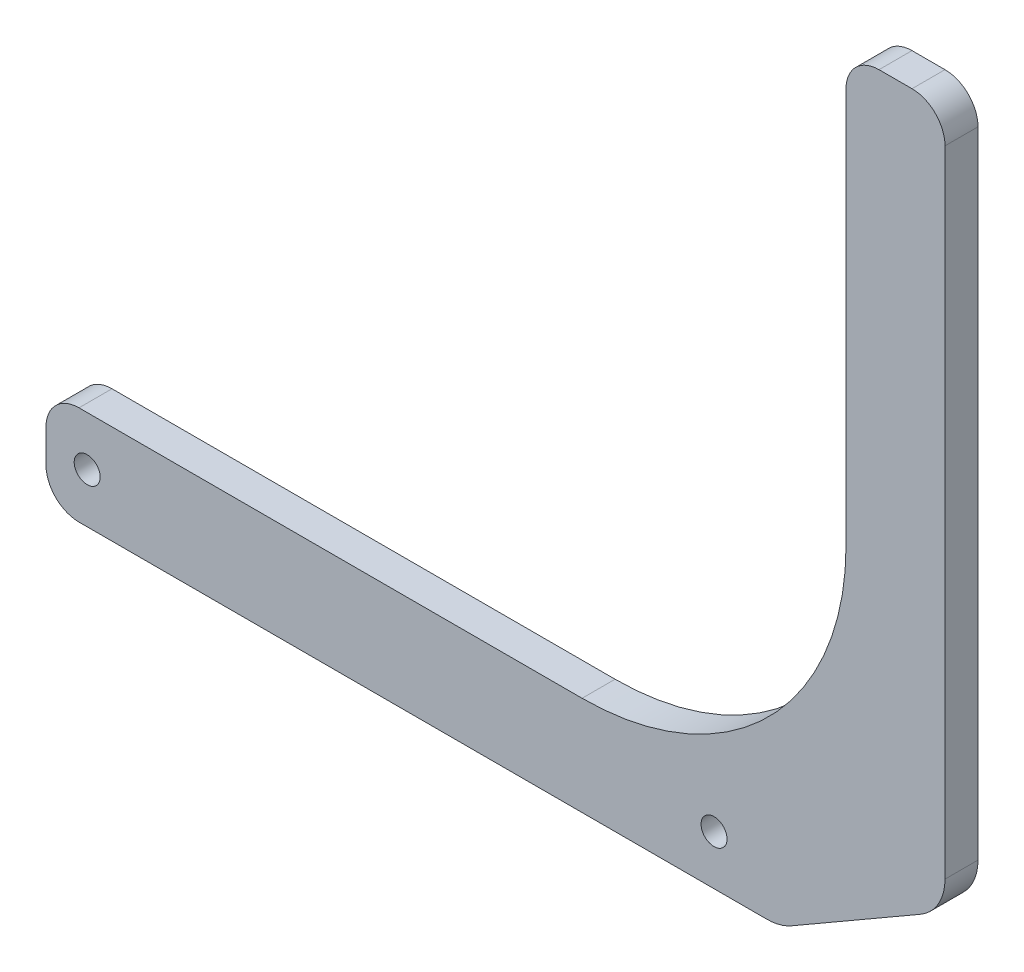
ISO-10303-21;
HEADER;
FILE_DESCRIPTION(('STEP AP214'),'2;1');
FILE_NAME('part.step','',(''),(''),'','','');
FILE_SCHEMA(('AUTOMOTIVE_DESIGN { 1 0 10303 214 1 1 1 1 }'));
ENDSEC;
DATA;
#1=APPLICATION_CONTEXT('core data for automotive mechanical design processes');
#2=APPLICATION_PROTOCOL_DEFINITION('international standard','automotive_design',2000,#1);
#3=PRODUCT_CONTEXT('',#1,'mechanical');
#4=PRODUCT('Part','Part','',(#3));
#5=PRODUCT_RELATED_PRODUCT_CATEGORY('part','',(#4));
#6=PRODUCT_DEFINITION_FORMATION('','',#4);
#7=PRODUCT_DEFINITION_CONTEXT('part definition',#1,'design');
#8=PRODUCT_DEFINITION('design','',#6,#7);
#9=PRODUCT_DEFINITION_SHAPE('','',#8);
#10=(LENGTH_UNIT() NAMED_UNIT(*) SI_UNIT(.MILLI.,.METRE.));
#11=(NAMED_UNIT(*) PLANE_ANGLE_UNIT() SI_UNIT($,.RADIAN.));
#12=(NAMED_UNIT(*) SI_UNIT($,.STERADIAN.) SOLID_ANGLE_UNIT());
#13=UNCERTAINTY_MEASURE_WITH_UNIT(LENGTH_MEASURE(1.E-05),#10,'distance_accuracy_value','');
#14=(GEOMETRIC_REPRESENTATION_CONTEXT(3) GLOBAL_UNCERTAINTY_ASSIGNED_CONTEXT((#13)) GLOBAL_UNIT_ASSIGNED_CONTEXT((#10,
#11,#12)) REPRESENTATION_CONTEXT('',''));
#15=CARTESIAN_POINT('',(0.,0.,0.));
#16=DIRECTION('',(0.,0.,1.));
#17=DIRECTION('',(1.,0.,0.));
#18=AXIS2_PLACEMENT_3D('',#15,#16,#17);
#19=CARTESIAN_POINT('',(-88.9,-9.525,6.35));
#20=DIRECTION('',(0.,1.,0.));
#21=DIRECTION('',(0.,0.,1.));
#22=AXIS2_PLACEMENT_3D('',#19,#20,#21);
#23=PLANE('',#22);
#24=DIRECTION('',(1.,0.,0.));
#25=VECTOR('',#24,1.);
#26=CARTESIAN_POINT('',(-88.9,-9.525,0.));
#27=LINE('',#26,#25);
#28=CARTESIAN_POINT('',(-77.7748,-9.525,0.));
#29=VERTEX_POINT('',#28);
#30=CARTESIAN_POINT('',(54.5977839420934,-9.525,0.));
#31=VERTEX_POINT('',#30);
#32=EDGE_CURVE('E171',#29,#31,#27,.T.);
#33=ORIENTED_EDGE('',*,*,#32,.T.);
#34=DIRECTION('',(0.,0.,-1.));
#35=VECTOR('',#34,1.);
#36=CARTESIAN_POINT('',(54.5977839420934,-9.525,6.35));
#37=LINE('',#36,#35);
#38=CARTESIAN_POINT('',(54.5977839420934,-9.525,6.35));
#39=VERTEX_POINT('',#38);
#40=EDGE_CURVE('E11',#31,#39,#37,.F.);
#41=ORIENTED_EDGE('',*,*,#40,.T.);
#42=DIRECTION('',(1.,0.,0.));
#43=VECTOR('',#42,1.);
#44=CARTESIAN_POINT('',(-88.9,-9.525,6.35));
#45=LINE('',#44,#43);
#46=CARTESIAN_POINT('',(-77.7748,-9.525,6.35));
#47=VERTEX_POINT('',#46);
#48=EDGE_CURVE('E176',#47,#39,#45,.T.);
#49=ORIENTED_EDGE('',*,*,#48,.F.);
#50=DIRECTION('',(0.,0.,1.));
#51=VECTOR('',#50,1.);
#52=CARTESIAN_POINT('',(-77.7748,-9.525,6.35));
#53=LINE('',#52,#51);
#54=EDGE_CURVE('E206',#47,#29,#53,.F.);
#55=ORIENTED_EDGE('',*,*,#54,.T.);
#56=EDGE_LOOP('',(#33,#41,#49,#55));
#57=FACE_BOUND('',#56,.T.);
#58=ADVANCED_FACE('F36',(#57),#23,.F.);
#59=CARTESIAN_POINT('',(88.9,9.525,6.35));
#60=DIRECTION('',(-1.,0.,0.));
#61=DIRECTION('',(0.,0.,1.));
#62=AXIS2_PLACEMENT_3D('',#59,#60,#61);
#63=PLANE('',#62);
#64=DIRECTION('',(0.,1.,0.));
#65=VECTOR('',#64,1.);
#66=CARTESIAN_POINT('',(88.9,9.525,6.35));
#67=LINE('',#66,#65);
#68=CARTESIAN_POINT('',(88.9,14.3051323608018,6.35));
#69=VERTEX_POINT('',#68);
#70=CARTESIAN_POINT('',(88.9,136.525,6.35));
#71=VERTEX_POINT('',#70);
#72=EDGE_CURVE('E235',#69,#71,#67,.T.);
#73=ORIENTED_EDGE('',*,*,#72,.F.);
#74=DIRECTION('',(0.,0.,1.));
#75=VECTOR('',#74,1.);
#76=CARTESIAN_POINT('',(88.9,14.3051323608018,0.));
#77=LINE('',#76,#75);
#78=CARTESIAN_POINT('',(88.9,14.3051323608018,0.));
#79=VERTEX_POINT('',#78);
#80=EDGE_CURVE('E220',#69,#79,#77,.F.);
#81=ORIENTED_EDGE('',*,*,#80,.T.);
#82=DIRECTION('',(0.,1.,0.));
#83=VECTOR('',#82,1.);
#84=CARTESIAN_POINT('',(88.9,9.525,0.));
#85=LINE('',#84,#83);
#86=CARTESIAN_POINT('',(88.9,136.525,0.));
#87=VERTEX_POINT('',#86);
#88=EDGE_CURVE('E166',#79,#87,#85,.T.);
#89=ORIENTED_EDGE('',*,*,#88,.T.);
#90=DIRECTION('',(0.,0.,-1.));
#91=VECTOR('',#90,1.);
#92=CARTESIAN_POINT('',(88.9,136.525,6.35));
#93=LINE('',#92,#91);
#94=EDGE_CURVE('E146',#87,#71,#93,.F.);
#95=ORIENTED_EDGE('',*,*,#94,.T.);
#96=EDGE_LOOP('',(#73,#81,#89,#95));
#97=FACE_BOUND('',#96,.T.);
#98=ADVANCED_FACE('F239',(#97),#63,.F.);
#99=CARTESIAN_POINT('',(69.85,142.875,6.35));
#100=DIRECTION('',(0.,-1.,0.));
#101=DIRECTION('',(0.,0.,-1.));
#102=AXIS2_PLACEMENT_3D('',#99,#100,#101);
#103=PLANE('',#102);
#104=DIRECTION('',(-1.,0.,0.));
#105=VECTOR('',#104,1.);
#106=CARTESIAN_POINT('',(69.85,142.875,6.35));
#107=LINE('',#106,#105);
#108=CARTESIAN_POINT('',(82.55,142.875,6.35));
#109=VERTEX_POINT('',#108);
#110=CARTESIAN_POINT('',(76.2,142.875,6.35));
#111=VERTEX_POINT('',#110);
#112=EDGE_CURVE('E159',#109,#111,#107,.T.);
#113=ORIENTED_EDGE('',*,*,#112,.F.);
#114=DIRECTION('',(0.,0.,-1.));
#115=VECTOR('',#114,1.);
#116=CARTESIAN_POINT('',(82.55,142.875,6.35));
#117=LINE('',#116,#115);
#118=CARTESIAN_POINT('',(82.55,142.875,0.));
#119=VERTEX_POINT('',#118);
#120=EDGE_CURVE('E144',#109,#119,#117,.T.);
#121=ORIENTED_EDGE('',*,*,#120,.T.);
#122=DIRECTION('',(-1.,0.,0.));
#123=VECTOR('',#122,1.);
#124=CARTESIAN_POINT('',(69.85,142.875,0.));
#125=LINE('',#124,#123);
#126=CARTESIAN_POINT('',(76.2,142.875,0.));
#127=VERTEX_POINT('',#126);
#128=EDGE_CURVE('E156',#119,#127,#125,.T.);
#129=ORIENTED_EDGE('',*,*,#128,.T.);
#130=DIRECTION('',(0.,0.,-1.));
#131=VECTOR('',#130,1.);
#132=CARTESIAN_POINT('',(76.2,142.875,6.35));
#133=LINE('',#132,#131);
#134=EDGE_CURVE('E161',#127,#111,#133,.F.);
#135=ORIENTED_EDGE('',*,*,#134,.T.);
#136=EDGE_LOOP('',(#113,#121,#129,#135));
#137=FACE_BOUND('',#136,.T.);
#138=ADVANCED_FACE('F155',(#137),#103,.F.);
#139=CARTESIAN_POINT('',(69.85,9.525,6.35));
#140=DIRECTION('',(1.,0.,0.));
#141=DIRECTION('',(0.,1.,0.));
#142=AXIS2_PLACEMENT_3D('',#139,#140,#141);
#143=PLANE('',#142);
#144=DIRECTION('',(0.,-1.,0.));
#145=VECTOR('',#144,1.);
#146=CARTESIAN_POINT('',(69.85,9.525,0.));
#147=LINE('',#146,#145);
#148=CARTESIAN_POINT('',(69.85,136.525,0.));
#149=VERTEX_POINT('',#148);
#150=CARTESIAN_POINT('',(69.85,60.325,0.));
#151=VERTEX_POINT('',#150);
#152=EDGE_CURVE('E165',#149,#151,#147,.T.);
#153=ORIENTED_EDGE('',*,*,#152,.T.);
#154=DIRECTION('',(0.,0.,-1.));
#155=VECTOR('',#154,1.);
#156=CARTESIAN_POINT('',(69.85,60.325,6.35));
#157=LINE('',#156,#155);
#158=CARTESIAN_POINT('',(69.85,60.325,6.35));
#159=VERTEX_POINT('',#158);
#160=EDGE_CURVE('E214',#151,#159,#157,.F.);
#161=ORIENTED_EDGE('',*,*,#160,.T.);
#162=DIRECTION('',(0.,-1.,0.));
#163=VECTOR('',#162,1.);
#164=CARTESIAN_POINT('',(69.85,9.525,6.35));
#165=LINE('',#164,#163);
#166=CARTESIAN_POINT('',(69.85,136.525,6.35));
#167=VERTEX_POINT('',#166);
#168=EDGE_CURVE('E257',#167,#159,#165,.T.);
#169=ORIENTED_EDGE('',*,*,#168,.F.);
#170=DIRECTION('',(0.,0.,-1.));
#171=VECTOR('',#170,1.);
#172=CARTESIAN_POINT('',(69.85,136.525,6.35));
#173=LINE('',#172,#171);
#174=EDGE_CURVE('E198',#167,#149,#173,.T.);
#175=ORIENTED_EDGE('',*,*,#174,.T.);
#176=EDGE_LOOP('',(#153,#161,#169,#175));
#177=FACE_BOUND('',#176,.T.);
#178=ADVANCED_FACE('F299',(#177),#143,.F.);
#179=CARTESIAN_POINT('',(-88.9,9.525,6.35));
#180=DIRECTION('',(0.,-1.,0.));
#181=DIRECTION('',(0.,0.,-1.));
#182=AXIS2_PLACEMENT_3D('',#179,#180,#181);
#183=PLANE('',#182);
#184=DIRECTION('',(-1.,0.,0.));
#185=VECTOR('',#184,1.);
#186=CARTESIAN_POINT('',(-88.9,9.525,6.35));
#187=LINE('',#186,#185);
#188=CARTESIAN_POINT('',(19.05,9.525,6.35));
#189=VERTEX_POINT('',#188);
#190=CARTESIAN_POINT('',(-77.7748,9.525,6.35));
#191=VERTEX_POINT('',#190);
#192=EDGE_CURVE('E181',#189,#191,#187,.T.);
#193=ORIENTED_EDGE('',*,*,#192,.F.);
#194=DIRECTION('',(0.,0.,-1.));
#195=VECTOR('',#194,1.);
#196=CARTESIAN_POINT('',(19.05,9.525,0.));
#197=LINE('',#196,#195);
#198=CARTESIAN_POINT('',(19.05,9.525,0.));
#199=VERTEX_POINT('',#198);
#200=EDGE_CURVE('E211',#189,#199,#197,.T.);
#201=ORIENTED_EDGE('',*,*,#200,.T.);
#202=DIRECTION('',(-1.,0.,0.));
#203=VECTOR('',#202,1.);
#204=CARTESIAN_POINT('',(-88.9,9.525,0.));
#205=LINE('',#204,#203);
#206=CARTESIAN_POINT('',(-77.7748,9.525,0.));
#207=VERTEX_POINT('',#206);
#208=EDGE_CURVE('E169',#199,#207,#205,.T.);
#209=ORIENTED_EDGE('',*,*,#208,.T.);
#210=DIRECTION('',(0.,0.,1.));
#211=VECTOR('',#210,1.);
#212=CARTESIAN_POINT('',(-77.7748,9.525,6.35));
#213=LINE('',#212,#211);
#214=EDGE_CURVE('E208',#207,#191,#213,.T.);
#215=ORIENTED_EDGE('',*,*,#214,.T.);
#216=EDGE_LOOP('',(#193,#201,#209,#215));
#217=FACE_BOUND('',#216,.T.);
#218=ADVANCED_FACE('F291',(#217),#183,.F.);
#219=CARTESIAN_POINT('',(-88.9,-9.525,6.35));
#220=DIRECTION('',(0.,0.,1.));
#221=DIRECTION('',(1.,0.,0.));
#222=AXIS2_PLACEMENT_3D('',#219,#220,#221);
#223=PLANE('',#222);
#224=DIRECTION('',(-0.86602540378444,-0.499999999999998,0.));
#225=VECTOR('',#224,1.);
#226=CARTESIAN_POINT('',(-52.3875000000003,-72.7665051113584,6.35));
#227=LINE('',#226,#225);
#228=CARTESIAN_POINT('',(59.3602839420934,-8.24889197104679,6.35));
#229=VERTEX_POINT('',#228);
#230=CARTESIAN_POINT('',(84.1375,6.05624038975505,6.35));
#231=VERTEX_POINT('',#230);
#232=EDGE_CURVE('E180',#229,#231,#227,.F.);
#233=ORIENTED_EDGE('',*,*,#232,.T.);
#234=CARTESIAN_POINT('',(79.375,14.3051323608018,6.35));
#235=DIRECTION('',(0.,0.,1.));
#236=DIRECTION('',(1.,0.,0.));
#237=AXIS2_PLACEMENT_3D('',#234,#235,#236);
#238=CIRCLE('',#237,9.525);
#239=EDGE_CURVE('E44',#231,#69,#238,.T.);
#240=ORIENTED_EDGE('',*,*,#239,.T.);
#241=ORIENTED_EDGE('',*,*,#72,.T.);
#242=CARTESIAN_POINT('',(82.55,136.525,6.35));
#243=DIRECTION('',(0.,0.,1.));
#244=DIRECTION('',(1.,0.,0.));
#245=AXIS2_PLACEMENT_3D('',#242,#243,#244);
#246=CIRCLE('',#245,6.35);
#247=EDGE_CURVE('E196',#71,#109,#246,.T.);
#248=ORIENTED_EDGE('',*,*,#247,.T.);
#249=ORIENTED_EDGE('',*,*,#112,.T.);
#250=CARTESIAN_POINT('',(76.2,136.525,6.35));
#251=DIRECTION('',(0.,0.,1.));
#252=DIRECTION('',(1.,0.,0.));
#253=AXIS2_PLACEMENT_3D('',#250,#251,#252);
#254=CIRCLE('',#253,6.35);
#255=EDGE_CURVE('E194',#111,#167,#254,.T.);
#256=ORIENTED_EDGE('',*,*,#255,.T.);
#257=ORIENTED_EDGE('',*,*,#168,.T.);
#258=CARTESIAN_POINT('',(19.05,60.325,6.35));
#259=DIRECTION('',(0.,0.,1.));
#260=DIRECTION('',(1.,0.,0.));
#261=AXIS2_PLACEMENT_3D('',#258,#259,#260);
#262=CIRCLE('',#261,50.8);
#263=EDGE_CURVE('E218',#159,#189,#262,.F.);
#264=ORIENTED_EDGE('',*,*,#263,.T.);
#265=ORIENTED_EDGE('',*,*,#192,.T.);
#266=CARTESIAN_POINT('',(-77.7748,3.175,6.35));
#267=DIRECTION('',(0.,0.,1.));
#268=DIRECTION('',(1.,0.,0.));
#269=AXIS2_PLACEMENT_3D('',#266,#267,#268);
#270=CIRCLE('',#269,6.35);
#271=CARTESIAN_POINT('',(-84.1248,3.175,6.35));
#272=VERTEX_POINT('',#271);
#273=EDGE_CURVE('E190',#191,#272,#270,.T.);
#274=ORIENTED_EDGE('',*,*,#273,.T.);
#275=DIRECTION('',(0.,1.,0.));
#276=VECTOR('',#275,1.);
#277=CARTESIAN_POINT('',(-84.1248,9.525,6.35));
#278=LINE('',#277,#276);
#279=CARTESIAN_POINT('',(-84.1248,-3.175,6.35));
#280=VERTEX_POINT('',#279);
#281=EDGE_CURVE('E270',#280,#272,#278,.T.);
#282=ORIENTED_EDGE('',*,*,#281,.F.);
#283=CARTESIAN_POINT('',(-77.7748,-3.175,6.35));
#284=DIRECTION('',(0.,0.,1.));
#285=DIRECTION('',(1.,0.,0.));
#286=AXIS2_PLACEMENT_3D('',#283,#284,#285);
#287=CIRCLE('',#286,6.35);
#288=EDGE_CURVE('E192',#280,#47,#287,.T.);
#289=ORIENTED_EDGE('',*,*,#288,.T.);
#290=ORIENTED_EDGE('',*,*,#48,.T.);
#291=CARTESIAN_POINT('',(54.5977839420934,0.,6.35));
#292=DIRECTION('',(0.,0.,1.));
#293=DIRECTION('',(1.,0.,0.));
#294=AXIS2_PLACEMENT_3D('',#291,#292,#293);
#295=CIRCLE('',#294,9.525);
#296=EDGE_CURVE('E51',#39,#229,#295,.T.);
#297=ORIENTED_EDGE('',*,*,#296,.T.);
#298=EDGE_LOOP('',(#233,#240,#241,#248,#249,#256,#257,#264,#265,#274,#282,#289,#290,#297));
#299=FACE_BOUND('',#298,.T.);
#300=CARTESIAN_POINT('',(-76.2,0.,6.35));
#301=DIRECTION('',(0.,0.,1.));
#302=DIRECTION('',(1.,0.,0.));
#303=AXIS2_PLACEMENT_3D('',#300,#301,#302);
#304=CIRCLE('',#303,2.5);
#305=CARTESIAN_POINT('',(-73.7,0.,6.35));
#306=VERTEX_POINT('',#305);
#307=EDGE_CURVE('E267',#306,#306,#304,.T.);
#308=ORIENTED_EDGE('',*,*,#307,.F.);
#309=EDGE_LOOP('',(#308));
#310=FACE_BOUND('',#309,.T.);
#311=CARTESIAN_POINT('',(44.45,0.,6.35));
#312=DIRECTION('',(0.,0.,1.));
#313=DIRECTION('',(1.,0.,0.));
#314=AXIS2_PLACEMENT_3D('',#311,#312,#313);
#315=CIRCLE('',#314,2.5);
#316=CARTESIAN_POINT('',(46.95,0.,6.35));
#317=VERTEX_POINT('',#316);
#318=EDGE_CURVE('E253',#317,#317,#315,.T.);
#319=ORIENTED_EDGE('',*,*,#318,.F.);
#320=EDGE_LOOP('',(#319));
#321=FACE_BOUND('',#320,.T.);
#322=ADVANCED_FACE('F233',(#299,#310,#321),#223,.T.);
#323=CARTESIAN_POINT('',(-88.9,-9.525,0.));
#324=DIRECTION('',(0.,0.,1.));
#325=DIRECTION('',(1.,0.,0.));
#326=AXIS2_PLACEMENT_3D('',#323,#324,#325);
#327=PLANE('',#326);
#328=CARTESIAN_POINT('',(-76.2,0.,0.));
#329=DIRECTION('',(0.,0.,1.));
#330=DIRECTION('',(1.,0.,0.));
#331=AXIS2_PLACEMENT_3D('',#328,#329,#330);
#332=CIRCLE('',#331,2.5);
#333=CARTESIAN_POINT('',(-73.7,0.,0.));
#334=VERTEX_POINT('',#333);
#335=EDGE_CURVE('E264',#334,#334,#332,.T.);
#336=ORIENTED_EDGE('',*,*,#335,.T.);
#337=EDGE_LOOP('',(#336));
#338=FACE_BOUND('',#337,.T.);
#339=CARTESIAN_POINT('',(44.45,0.,0.));
#340=DIRECTION('',(0.,0.,1.));
#341=DIRECTION('',(1.,0.,0.));
#342=AXIS2_PLACEMENT_3D('',#339,#340,#341);
#343=CIRCLE('',#342,2.5);
#344=CARTESIAN_POINT('',(46.95,0.,0.));
#345=VERTEX_POINT('',#344);
#346=EDGE_CURVE('E251',#345,#345,#343,.T.);
#347=ORIENTED_EDGE('',*,*,#346,.T.);
#348=EDGE_LOOP('',(#347));
#349=FACE_BOUND('',#348,.T.);
#350=ORIENTED_EDGE('',*,*,#88,.F.);
#351=CARTESIAN_POINT('',(79.375,14.3051323608018,0.));
#352=DIRECTION('',(0.,0.,1.));
#353=DIRECTION('',(1.,0.,0.));
#354=AXIS2_PLACEMENT_3D('',#351,#352,#353);
#355=CIRCLE('',#354,9.525);
#356=CARTESIAN_POINT('',(84.1375,6.05624038975505,0.));
#357=VERTEX_POINT('',#356);
#358=EDGE_CURVE('E225',#79,#357,#355,.F.);
#359=ORIENTED_EDGE('',*,*,#358,.T.);
#360=DIRECTION('',(0.86602540378444,0.499999999999998,0.));
#361=VECTOR('',#360,1.);
#362=CARTESIAN_POINT('',(88.9,8.80587104677064,0.));
#363=LINE('',#362,#361);
#364=CARTESIAN_POINT('',(59.3602839420933,-8.2488919710468,0.));
#365=VERTEX_POINT('',#364);
#366=EDGE_CURVE('E177',#357,#365,#363,.F.);
#367=ORIENTED_EDGE('',*,*,#366,.T.);
#368=CARTESIAN_POINT('',(54.5977839420934,0.,0.));
#369=DIRECTION('',(0.,0.,1.));
#370=DIRECTION('',(1.,0.,0.));
#371=AXIS2_PLACEMENT_3D('',#368,#369,#370);
#372=CIRCLE('',#371,9.525);
#373=EDGE_CURVE('E223',#365,#31,#372,.F.);
#374=ORIENTED_EDGE('',*,*,#373,.T.);
#375=ORIENTED_EDGE('',*,*,#32,.F.);
#376=CARTESIAN_POINT('',(-77.7748,-3.175,0.));
#377=DIRECTION('',(0.,0.,1.));
#378=DIRECTION('',(1.,0.,0.));
#379=AXIS2_PLACEMENT_3D('',#376,#377,#378);
#380=CIRCLE('',#379,6.35);
#381=CARTESIAN_POINT('',(-84.1248,-3.175,0.));
#382=VERTEX_POINT('',#381);
#383=EDGE_CURVE('E186',#29,#382,#380,.F.);
#384=ORIENTED_EDGE('',*,*,#383,.T.);
#385=DIRECTION('',(0.,-1.,0.));
#386=VECTOR('',#385,1.);
#387=CARTESIAN_POINT('',(-84.1248,9.525,0.));
#388=LINE('',#387,#386);
#389=CARTESIAN_POINT('',(-84.1248,3.175,0.));
#390=VERTEX_POINT('',#389);
#391=EDGE_CURVE('E273',#390,#382,#388,.T.);
#392=ORIENTED_EDGE('',*,*,#391,.F.);
#393=CARTESIAN_POINT('',(-77.7748,3.175,0.));
#394=DIRECTION('',(0.,0.,1.));
#395=DIRECTION('',(1.,0.,0.));
#396=AXIS2_PLACEMENT_3D('',#393,#394,#395);
#397=CIRCLE('',#396,6.35);
#398=EDGE_CURVE('E160',#390,#207,#397,.F.);
#399=ORIENTED_EDGE('',*,*,#398,.T.);
#400=ORIENTED_EDGE('',*,*,#208,.F.);
#401=CARTESIAN_POINT('',(19.05,60.325,0.));
#402=DIRECTION('',(0.,0.,1.));
#403=DIRECTION('',(1.,0.,0.));
#404=AXIS2_PLACEMENT_3D('',#401,#402,#403);
#405=CIRCLE('',#404,50.8);
#406=EDGE_CURVE('E216',#199,#151,#405,.T.);
#407=ORIENTED_EDGE('',*,*,#406,.T.);
#408=ORIENTED_EDGE('',*,*,#152,.F.);
#409=CARTESIAN_POINT('',(76.2,136.525,0.));
#410=DIRECTION('',(0.,0.,1.));
#411=DIRECTION('',(1.,0.,0.));
#412=AXIS2_PLACEMENT_3D('',#409,#410,#411);
#413=CIRCLE('',#412,6.35);
#414=EDGE_CURVE('E150',#149,#127,#413,.F.);
#415=ORIENTED_EDGE('',*,*,#414,.T.);
#416=ORIENTED_EDGE('',*,*,#128,.F.);
#417=CARTESIAN_POINT('',(82.55,136.525,0.));
#418=DIRECTION('',(0.,0.,1.));
#419=DIRECTION('',(1.,0.,0.));
#420=AXIS2_PLACEMENT_3D('',#417,#418,#419);
#421=CIRCLE('',#420,6.35);
#422=EDGE_CURVE('E140',#119,#87,#421,.F.);
#423=ORIENTED_EDGE('',*,*,#422,.T.);
#424=EDGE_LOOP('',(#350,#359,#367,#374,#375,#384,#392,#399,#400,#407,#408,#415,#416,#423));
#425=FACE_BOUND('',#424,.T.);
#426=ADVANCED_FACE('F163',(#338,#349,#425),#327,.F.);
#427=CARTESIAN_POINT('',(44.45,0.,6.35));
#428=DIRECTION('',(0.,0.,1.));
#429=DIRECTION('',(1.,0.,0.));
#430=AXIS2_PLACEMENT_3D('',#427,#428,#429);
#431=CYLINDRICAL_SURFACE('',#430,2.5);
#432=ORIENTED_EDGE('',*,*,#346,.F.);
#433=EDGE_LOOP('',(#432));
#434=FACE_BOUND('',#433,.T.);
#435=ORIENTED_EDGE('',*,*,#318,.T.);
#436=EDGE_LOOP('',(#435));
#437=FACE_BOUND('',#436,.T.);
#438=ADVANCED_FACE('F327',(#434,#437),#431,.F.);
#439=CARTESIAN_POINT('',(-76.2,0.,6.35));
#440=DIRECTION('',(0.,0.,1.));
#441=DIRECTION('',(1.,0.,0.));
#442=AXIS2_PLACEMENT_3D('',#439,#440,#441);
#443=CYLINDRICAL_SURFACE('',#442,2.5);
#444=ORIENTED_EDGE('',*,*,#335,.F.);
#445=EDGE_LOOP('',(#444));
#446=FACE_BOUND('',#445,.T.);
#447=ORIENTED_EDGE('',*,*,#307,.T.);
#448=EDGE_LOOP('',(#447));
#449=FACE_BOUND('',#448,.T.);
#450=ADVANCED_FACE('F321',(#446,#449),#443,.F.);
#451=CARTESIAN_POINT('',(88.9,8.80587104677064,6.35));
#452=DIRECTION('',(-0.499999999999998,0.86602540378444,0.));
#453=DIRECTION('',(-0.86602540378444,-0.499999999999998,0.));
#454=AXIS2_PLACEMENT_3D('',#451,#452,#453);
#455=PLANE('',#454);
#456=ORIENTED_EDGE('',*,*,#366,.F.);
#457=DIRECTION('',(0.,0.,-1.));
#458=VECTOR('',#457,1.);
#459=CARTESIAN_POINT('',(84.1375,6.05624038975505,6.35));
#460=LINE('',#459,#458);
#461=EDGE_CURVE('E58',#357,#231,#460,.F.);
#462=ORIENTED_EDGE('',*,*,#461,.T.);
#463=ORIENTED_EDGE('',*,*,#232,.F.);
#464=DIRECTION('',(0.,0.,1.));
#465=VECTOR('',#464,1.);
#466=CARTESIAN_POINT('',(59.3602839420933,-8.2488919710468,0.));
#467=LINE('',#466,#465);
#468=EDGE_CURVE('E227',#229,#365,#467,.F.);
#469=ORIENTED_EDGE('',*,*,#468,.T.);
#470=EDGE_LOOP('',(#456,#462,#463,#469));
#471=FACE_BOUND('',#470,.T.);
#472=ADVANCED_FACE('F243',(#471),#455,.F.);
#473=CARTESIAN_POINT('',(-84.1248,9.525,-0.00100000000000013));
#474=DIRECTION('',(1.,0.,0.));
#475=DIRECTION('',(0.,0.,-1.));
#476=AXIS2_PLACEMENT_3D('',#473,#474,#475);
#477=PLANE('',#476);
#478=ORIENTED_EDGE('',*,*,#391,.T.);
#479=DIRECTION('',(0.,0.,1.));
#480=VECTOR('',#479,1.);
#481=CARTESIAN_POINT('',(-84.1248,-3.175,-0.00100000000000013));
#482=LINE('',#481,#480);
#483=EDGE_CURVE('E203',#382,#280,#482,.T.);
#484=ORIENTED_EDGE('',*,*,#483,.T.);
#485=ORIENTED_EDGE('',*,*,#281,.T.);
#486=DIRECTION('',(0.,0.,1.));
#487=VECTOR('',#486,1.);
#488=CARTESIAN_POINT('',(-84.1248,3.175,-0.00100000000000013));
#489=LINE('',#488,#487);
#490=EDGE_CURVE('E201',#272,#390,#489,.F.);
#491=ORIENTED_EDGE('',*,*,#490,.T.);
#492=EDGE_LOOP('',(#478,#484,#485,#491));
#493=FACE_BOUND('',#492,.T.);
#494=ADVANCED_FACE('F278',(#493),#477,.F.);
#495=CARTESIAN_POINT('',(82.55,136.525,6.35));
#496=DIRECTION('',(0.,0.,-1.));
#497=DIRECTION('',(-1.,0.,0.));
#498=AXIS2_PLACEMENT_3D('',#495,#496,#497);
#499=CYLINDRICAL_SURFACE('',#498,6.35);
#500=ORIENTED_EDGE('',*,*,#247,.F.);
#501=ORIENTED_EDGE('',*,*,#94,.F.);
#502=ORIENTED_EDGE('',*,*,#422,.F.);
#503=ORIENTED_EDGE('',*,*,#120,.F.);
#504=EDGE_LOOP('',(#500,#501,#502,#503));
#505=FACE_BOUND('',#504,.T.);
#506=ADVANCED_FACE('F143',(#505),#499,.T.);
#507=CARTESIAN_POINT('',(76.2,136.525,6.35));
#508=DIRECTION('',(0.,0.,-1.));
#509=DIRECTION('',(-1.,0.,0.));
#510=AXIS2_PLACEMENT_3D('',#507,#508,#509);
#511=CYLINDRICAL_SURFACE('',#510,6.35);
#512=ORIENTED_EDGE('',*,*,#255,.F.);
#513=ORIENTED_EDGE('',*,*,#134,.F.);
#514=ORIENTED_EDGE('',*,*,#414,.F.);
#515=ORIENTED_EDGE('',*,*,#174,.F.);
#516=EDGE_LOOP('',(#512,#513,#514,#515));
#517=FACE_BOUND('',#516,.T.);
#518=ADVANCED_FACE('F303',(#517),#511,.T.);
#519=CARTESIAN_POINT('',(-77.7748,-3.175,-0.00100000000000013));
#520=DIRECTION('',(0.,0.,1.));
#521=DIRECTION('',(1.,0.,0.));
#522=AXIS2_PLACEMENT_3D('',#519,#520,#521);
#523=CYLINDRICAL_SURFACE('',#522,6.35);
#524=ORIENTED_EDGE('',*,*,#383,.F.);
#525=ORIENTED_EDGE('',*,*,#54,.F.);
#526=ORIENTED_EDGE('',*,*,#288,.F.);
#527=ORIENTED_EDGE('',*,*,#483,.F.);
#528=EDGE_LOOP('',(#524,#525,#526,#527));
#529=FACE_BOUND('',#528,.T.);
#530=ADVANCED_FACE('F283',(#529),#523,.T.);
#531=CARTESIAN_POINT('',(-77.7748,3.175,6.35));
#532=DIRECTION('',(0.,0.,1.));
#533=DIRECTION('',(1.,0.,0.));
#534=AXIS2_PLACEMENT_3D('',#531,#532,#533);
#535=CYLINDRICAL_SURFACE('',#534,6.35);
#536=ORIENTED_EDGE('',*,*,#398,.F.);
#537=ORIENTED_EDGE('',*,*,#490,.F.);
#538=ORIENTED_EDGE('',*,*,#273,.F.);
#539=ORIENTED_EDGE('',*,*,#214,.F.);
#540=EDGE_LOOP('',(#536,#537,#538,#539));
#541=FACE_BOUND('',#540,.T.);
#542=ADVANCED_FACE('F286',(#541),#535,.T.);
#543=CARTESIAN_POINT('',(19.05,60.325,6.35));
#544=DIRECTION('',(0.,0.,1.));
#545=DIRECTION('',(1.,0.,0.));
#546=AXIS2_PLACEMENT_3D('',#543,#544,#545);
#547=CYLINDRICAL_SURFACE('',#546,50.8);
#548=ORIENTED_EDGE('',*,*,#263,.F.);
#549=ORIENTED_EDGE('',*,*,#160,.F.);
#550=ORIENTED_EDGE('',*,*,#406,.F.);
#551=ORIENTED_EDGE('',*,*,#200,.F.);
#552=EDGE_LOOP('',(#548,#549,#550,#551));
#553=FACE_BOUND('',#552,.T.);
#554=ADVANCED_FACE('F295',(#553),#547,.F.);
#555=CARTESIAN_POINT('',(79.375,14.3051323608018,6.35));
#556=DIRECTION('',(0.,0.,-1.));
#557=DIRECTION('',(-1.,0.,0.));
#558=AXIS2_PLACEMENT_3D('',#555,#556,#557);
#559=CYLINDRICAL_SURFACE('',#558,9.525);
#560=ORIENTED_EDGE('',*,*,#239,.F.);
#561=ORIENTED_EDGE('',*,*,#461,.F.);
#562=ORIENTED_EDGE('',*,*,#358,.F.);
#563=ORIENTED_EDGE('',*,*,#80,.F.);
#564=EDGE_LOOP('',(#560,#561,#562,#563));
#565=FACE_BOUND('',#564,.T.);
#566=ADVANCED_FACE('F241',(#565),#559,.T.);
#567=CARTESIAN_POINT('',(54.5977839420934,0.,6.35));
#568=DIRECTION('',(0.,0.,1.));
#569=DIRECTION('',(1.,0.,0.));
#570=AXIS2_PLACEMENT_3D('',#567,#568,#569);
#571=CYLINDRICAL_SURFACE('',#570,9.525);
#572=ORIENTED_EDGE('',*,*,#373,.F.);
#573=ORIENTED_EDGE('',*,*,#468,.F.);
#574=ORIENTED_EDGE('',*,*,#296,.F.);
#575=ORIENTED_EDGE('',*,*,#40,.F.);
#576=EDGE_LOOP('',(#572,#573,#574,#575));
#577=FACE_BOUND('',#576,.T.);
#578=ADVANCED_FACE('F38',(#577),#571,.T.);
#579=CLOSED_SHELL('',(#58,#98,#138,#178,#218,#322,#426,#438,#450,#472,#494,#506,#518,#530,#542,
#554,#566,#578));
#580=MANIFOLD_SOLID_BREP('B2',#579);
#581=ADVANCED_BREP_SHAPE_REPRESENTATION('',(#18,#580),#14);
#582=SHAPE_DEFINITION_REPRESENTATION(#9,#581);
ENDSEC;
END-ISO-10303-21;
